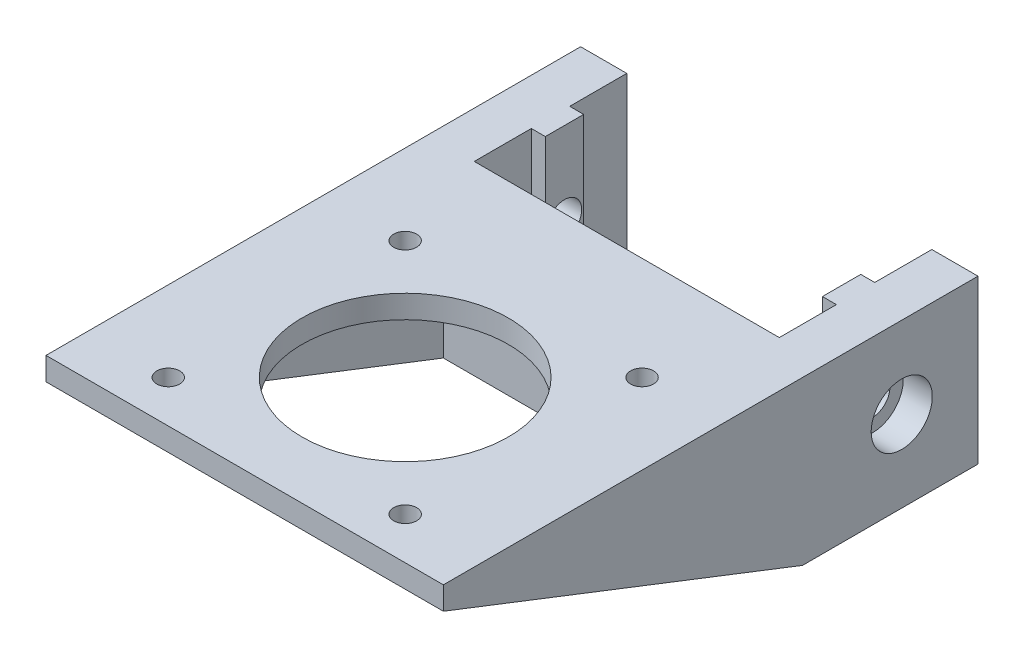
ISO-10303-21;
HEADER;
FILE_DESCRIPTION(('STEP AP214'),'2;1');
FILE_NAME('part.step','',(''),(''),'','','');
FILE_SCHEMA(('AUTOMOTIVE_DESIGN { 1 0 10303 214 1 1 1 1 }'));
ENDSEC;
DATA;
#1=APPLICATION_CONTEXT('core data for automotive mechanical design processes');
#2=APPLICATION_PROTOCOL_DEFINITION('international standard','automotive_design',2000,#1);
#3=PRODUCT_CONTEXT('',#1,'mechanical');
#4=PRODUCT('Part','Part','',(#3));
#5=PRODUCT_RELATED_PRODUCT_CATEGORY('part','',(#4));
#6=PRODUCT_DEFINITION_FORMATION('','',#4);
#7=PRODUCT_DEFINITION_CONTEXT('part definition',#1,'design');
#8=PRODUCT_DEFINITION('design','',#6,#7);
#9=PRODUCT_DEFINITION_SHAPE('','',#8);
#10=(LENGTH_UNIT() NAMED_UNIT(*) SI_UNIT(.MILLI.,.METRE.));
#11=(NAMED_UNIT(*) PLANE_ANGLE_UNIT() SI_UNIT($,.RADIAN.));
#12=(NAMED_UNIT(*) SI_UNIT($,.STERADIAN.) SOLID_ANGLE_UNIT());
#13=UNCERTAINTY_MEASURE_WITH_UNIT(LENGTH_MEASURE(1.E-05),#10,'distance_accuracy_value','');
#14=(GEOMETRIC_REPRESENTATION_CONTEXT(3) GLOBAL_UNCERTAINTY_ASSIGNED_CONTEXT((#13)) GLOBAL_UNIT_ASSIGNED_CONTEXT((#10,
#11,#12)) REPRESENTATION_CONTEXT('',''));
#15=CARTESIAN_POINT('',(0.,0.,0.));
#16=DIRECTION('',(0.,0.,1.));
#17=DIRECTION('',(1.,0.,0.));
#18=AXIS2_PLACEMENT_3D('',#15,#16,#17);
#19=CARTESIAN_POINT('',(124.14478391515,157.565968794144,0.));
#20=DIRECTION('',(1.,0.,0.));
#21=DIRECTION('',(0.,0.,-1.));
#22=AXIS2_PLACEMENT_3D('',#19,#20,#21);
#23=PLANE('',#22);
#24=DIRECTION('',(0.,0.,-1.));
#25=VECTOR('',#24,1.);
#26=CARTESIAN_POINT('',(124.14478391515,157.565968794144,3.));
#27=LINE('',#26,#25);
#28=CARTESIAN_POINT('',(124.14478391515,157.565968794144,3.));
#29=VERTEX_POINT('',#28);
#30=CARTESIAN_POINT('',(124.14478391515,157.565968794144,-19.96));
#31=VERTEX_POINT('',#30);
#32=EDGE_CURVE('E369',#29,#31,#27,.T.);
#33=ORIENTED_EDGE('',*,*,#32,.T.);
#34=DIRECTION('',(0.,1.,0.));
#35=VECTOR('',#34,1.);
#36=CARTESIAN_POINT('',(124.14478391515,136.712115433194,-19.96));
#37=LINE('',#36,#35);
#38=CARTESIAN_POINT('',(124.14478391515,178.865968794144,-19.96));
#39=VERTEX_POINT('',#38);
#40=EDGE_CURVE('E225',#31,#39,#37,.T.);
#41=ORIENTED_EDGE('',*,*,#40,.T.);
#42=DIRECTION('',(0.,0.,1.));
#43=VECTOR('',#42,1.);
#44=CARTESIAN_POINT('',(124.14478391515,178.865968794144,0.));
#45=LINE('',#44,#43);
#46=CARTESIAN_POINT('',(124.14478391515,178.865968794144,50.));
#47=VERTEX_POINT('',#46);
#48=EDGE_CURVE('E371',#39,#47,#45,.T.);
#49=ORIENTED_EDGE('',*,*,#48,.T.);
#50=DIRECTION('',(0.,-1.,0.));
#51=VECTOR('',#50,1.);
#52=CARTESIAN_POINT('',(124.14478391515,178.865968794144,50.));
#53=LINE('',#52,#51);
#54=CARTESIAN_POINT('',(124.14478391515,175.865968794144,50.));
#55=VERTEX_POINT('',#54);
#56=EDGE_CURVE('E373',#47,#55,#53,.T.);
#57=ORIENTED_EDGE('',*,*,#56,.T.);
#58=DIRECTION('',(0.,-0.362828944730076,-0.931855759689266));
#59=VECTOR('',#58,1.);
#60=CARTESIAN_POINT('',(124.14478391515,175.865968794144,50.));
#61=LINE('',#60,#59);
#62=EDGE_CURVE('E375',#55,#29,#61,.T.);
#63=ORIENTED_EDGE('',*,*,#62,.T.);
#64=EDGE_LOOP('',(#33,#41,#49,#57,#63));
#65=FACE_BOUND('',#64,.T.);
#66=CARTESIAN_POINT('',(124.14478391515,168.215968794144,-9.98));
#67=DIRECTION('',(-1.,0.,0.));
#68=DIRECTION('',(0.,0.,1.));
#69=AXIS2_PLACEMENT_3D('',#66,#67,#68);
#70=CIRCLE('',#69,4.);
#71=CARTESIAN_POINT('',(124.14478391515,168.215968794144,-5.98));
#72=VERTEX_POINT('',#71);
#73=EDGE_CURVE('E859',#72,#72,#70,.T.);
#74=ORIENTED_EDGE('',*,*,#73,.T.);
#75=EDGE_LOOP('',(#74));
#76=FACE_BOUND('',#75,.T.);
#77=ADVANCED_FACE('F37',(#65,#76),#23,.T.);
#78=CARTESIAN_POINT('',(114.14478391515,168.215968794144,-9.98));
#79=DIRECTION('',(1.,0.,0.));
#80=DIRECTION('',(0.,0.,-1.));
#81=AXIS2_PLACEMENT_3D('',#78,#79,#80);
#82=CYLINDRICAL_SURFACE('',#81,2.25);
#83=CARTESIAN_POINT('',(116.274788364624,168.215968794144,-9.98));
#84=DIRECTION('',(1.,0.,0.));
#85=DIRECTION('',(0.,0.,-1.));
#86=AXIS2_PLACEMENT_3D('',#83,#84,#85);
#87=CIRCLE('',#86,2.25);
#88=CARTESIAN_POINT('',(116.274788364624,168.215968794144,-12.23));
#89=VERTEX_POINT('',#88);
#90=EDGE_CURVE('E198',#89,#89,#87,.F.);
#91=ORIENTED_EDGE('',*,*,#90,.T.);
#92=EDGE_LOOP('',(#91));
#93=FACE_BOUND('',#92,.T.);
#94=CARTESIAN_POINT('',(120.34478391515,168.215968794144,-9.98));
#95=DIRECTION('',(1.,0.,0.));
#96=DIRECTION('',(0.,0.,-1.));
#97=AXIS2_PLACEMENT_3D('',#94,#95,#96);
#98=CIRCLE('',#97,2.25);
#99=CARTESIAN_POINT('',(120.34478391515,168.215968794144,-12.23));
#100=VERTEX_POINT('',#99);
#101=EDGE_CURVE('E41',#100,#100,#98,.T.);
#102=ORIENTED_EDGE('',*,*,#101,.T.);
#103=EDGE_LOOP('',(#102));
#104=FACE_BOUND('',#103,.T.);
#105=ADVANCED_FACE('F474',(#93,#104),#82,.F.);
#106=CARTESIAN_POINT('',(116.274788364624,184.209121769209,-7.47));
#107=DIRECTION('',(1.,0.,0.));
#108=DIRECTION('',(0.,0.,-1.));
#109=AXIS2_PLACEMENT_3D('',#106,#107,#108);
#110=PLANE('',#109);
#111=DIRECTION('',(0.,-1.,0.));
#112=VECTOR('',#111,1.);
#113=CARTESIAN_POINT('',(116.274788364624,184.209121769209,-7.47));
#114=LINE('',#113,#112);
#115=CARTESIAN_POINT('',(116.274788364624,178.865968794144,-7.47));
#116=VERTEX_POINT('',#115);
#117=CARTESIAN_POINT('',(116.274788364624,157.565968794144,-7.47));
#118=VERTEX_POINT('',#117);
#119=EDGE_CURVE('E176',#116,#118,#114,.T.);
#120=ORIENTED_EDGE('',*,*,#119,.F.);
#121=DIRECTION('',(0.,0.,-1.));
#122=VECTOR('',#121,1.);
#123=CARTESIAN_POINT('',(116.274788364624,178.865968794144,-7.47));
#124=LINE('',#123,#122);
#125=CARTESIAN_POINT('',(116.274788364624,178.865968794144,-12.49));
#126=VERTEX_POINT('',#125);
#127=EDGE_CURVE('E212',#116,#126,#124,.T.);
#128=ORIENTED_EDGE('',*,*,#127,.T.);
#129=DIRECTION('',(0.,-1.,0.));
#130=VECTOR('',#129,1.);
#131=CARTESIAN_POINT('',(116.274788364624,184.209121769209,-12.49));
#132=LINE('',#131,#130);
#133=CARTESIAN_POINT('',(116.274788364624,157.565968794144,-12.49));
#134=VERTEX_POINT('',#133);
#135=EDGE_CURVE('E184',#126,#134,#132,.T.);
#136=ORIENTED_EDGE('',*,*,#135,.T.);
#137=DIRECTION('',(0.,0.,1.));
#138=VECTOR('',#137,1.);
#139=CARTESIAN_POINT('',(116.274788364624,157.565968794144,-7.47));
#140=LINE('',#139,#138);
#141=EDGE_CURVE('E187',#134,#118,#140,.T.);
#142=ORIENTED_EDGE('',*,*,#141,.T.);
#143=EDGE_LOOP('',(#120,#128,#136,#142));
#144=FACE_BOUND('',#143,.T.);
#145=ORIENTED_EDGE('',*,*,#90,.F.);
#146=EDGE_LOOP('',(#145));
#147=FACE_BOUND('',#146,.T.);
#148=ADVANCED_FACE('F188',(#144,#147),#110,.F.);
#149=CARTESIAN_POINT('',(118.10478391515,136.712115433194,-19.96));
#150=DIRECTION('',(1.,0.,0.));
#151=DIRECTION('',(0.,0.,-1.));
#152=AXIS2_PLACEMENT_3D('',#149,#150,#151);
#153=PLANE('',#152);
#154=DIRECTION('',(0.,-1.,0.));
#155=VECTOR('',#154,1.);
#156=CARTESIAN_POINT('',(118.10478391515,184.209121769209,-7.47));
#157=LINE('',#156,#155);
#158=CARTESIAN_POINT('',(118.10478391515,178.865968794144,-7.47));
#159=VERTEX_POINT('',#158);
#160=CARTESIAN_POINT('',(118.10478391515,157.565968794144,-7.47));
#161=VERTEX_POINT('',#160);
#162=EDGE_CURVE('E59',#159,#161,#157,.T.);
#163=ORIENTED_EDGE('',*,*,#162,.T.);
#164=DIRECTION('',(0.,0.,1.));
#165=VECTOR('',#164,1.);
#166=CARTESIAN_POINT('',(118.10478391515,157.565968794144,-19.96));
#167=LINE('',#166,#165);
#168=CARTESIAN_POINT('',(118.10478391515,157.565968794144,0.));
#169=VERTEX_POINT('',#168);
#170=EDGE_CURVE('E197',#161,#169,#167,.T.);
#171=ORIENTED_EDGE('',*,*,#170,.T.);
#172=DIRECTION('',(0.,1.,0.));
#173=VECTOR('',#172,1.);
#174=CARTESIAN_POINT('',(118.10478391515,136.712115433194,0.));
#175=LINE('',#174,#173);
#176=CARTESIAN_POINT('',(118.10478391515,178.865968794144,0.));
#177=VERTEX_POINT('',#176);
#178=EDGE_CURVE('E216',#169,#177,#175,.T.);
#179=ORIENTED_EDGE('',*,*,#178,.T.);
#180=DIRECTION('',(0.,0.,-1.));
#181=VECTOR('',#180,1.);
#182=CARTESIAN_POINT('',(118.10478391515,178.865968794144,-19.96));
#183=LINE('',#182,#181);
#184=EDGE_CURVE('E54',#177,#159,#183,.T.);
#185=ORIENTED_EDGE('',*,*,#184,.T.);
#186=EDGE_LOOP('',(#163,#171,#179,#185));
#187=FACE_BOUND('',#186,.T.);
#188=ADVANCED_FACE('F653',(#187),#153,.F.);
#189=DIRECTION('',(0.,-1.,0.));
#190=VECTOR('',#189,1.);
#191=CARTESIAN_POINT('',(118.10478391515,184.209121769209,-12.49));
#192=LINE('',#191,#190);
#193=CARTESIAN_POINT('',(118.10478391515,178.865968794144,-12.49));
#194=VERTEX_POINT('',#193);
#195=CARTESIAN_POINT('',(118.10478391515,157.565968794144,-12.49));
#196=VERTEX_POINT('',#195);
#197=EDGE_CURVE('E206',#194,#196,#192,.T.);
#198=ORIENTED_EDGE('',*,*,#197,.F.);
#199=CARTESIAN_POINT('',(118.10478391515,178.865968794144,-19.96));
#200=VERTEX_POINT('',#199);
#201=EDGE_CURVE('E223',#194,#200,#183,.T.);
#202=ORIENTED_EDGE('',*,*,#201,.T.);
#203=DIRECTION('',(0.,1.,0.));
#204=VECTOR('',#203,1.);
#205=CARTESIAN_POINT('',(118.10478391515,136.712115433194,-19.96));
#206=LINE('',#205,#204);
#207=CARTESIAN_POINT('',(118.10478391515,157.565968794144,-19.96));
#208=VERTEX_POINT('',#207);
#209=EDGE_CURVE('E227',#208,#200,#206,.T.);
#210=ORIENTED_EDGE('',*,*,#209,.F.);
#211=EDGE_CURVE('E217',#208,#196,#167,.T.);
#212=ORIENTED_EDGE('',*,*,#211,.T.);
#213=EDGE_LOOP('',(#198,#202,#210,#212));
#214=FACE_BOUND('',#213,.T.);
#215=ADVANCED_FACE('F534',(#214),#153,.F.);
#216=CARTESIAN_POINT('',(77.1447839151503,178.865968794144,0.));
#217=DIRECTION('',(0.,0.,-1.));
#218=DIRECTION('',(-1.,0.,0.));
#219=AXIS2_PLACEMENT_3D('',#216,#217,#218);
#220=PLANE('',#219);
#221=CARTESIAN_POINT('',(88.6447839151503,166.065968794144,0.));
#222=DIRECTION('',(0.,0.,1.));
#223=DIRECTION('',(1.,0.,0.));
#224=AXIS2_PLACEMENT_3D('',#221,#222,#223);
#225=CIRCLE('',#224,3.00000000000001);
#226=CARTESIAN_POINT('',(91.6447839151503,166.065968794144,0.));
#227=VERTEX_POINT('',#226);
#228=EDGE_CURVE('E426',#227,#227,#225,.T.);
#229=ORIENTED_EDGE('',*,*,#228,.T.);
#230=EDGE_LOOP('',(#229));
#231=FACE_BOUND('',#230,.T.);
#232=CARTESIAN_POINT('',(108.64478391515,166.065968794144,0.));
#233=DIRECTION('',(0.,0.,1.));
#234=DIRECTION('',(1.,0.,0.));
#235=AXIS2_PLACEMENT_3D('',#232,#233,#234);
#236=CIRCLE('',#235,3.00000000000001);
#237=CARTESIAN_POINT('',(111.64478391515,166.065968794144,0.));
#238=VERTEX_POINT('',#237);
#239=EDGE_CURVE('E310',#238,#238,#236,.T.);
#240=ORIENTED_EDGE('',*,*,#239,.T.);
#241=EDGE_LOOP('',(#240));
#242=FACE_BOUND('',#241,.T.);
#243=DIRECTION('',(-1.,0.,0.));
#244=VECTOR('',#243,1.);
#245=CARTESIAN_POINT('',(77.1447839151503,178.865968794144,0.));
#246=LINE('',#245,#244);
#247=CARTESIAN_POINT('',(78.1847839151502,178.865968794144,0.));
#248=VERTEX_POINT('',#247);
#249=EDGE_CURVE('E302',#177,#248,#246,.T.);
#250=ORIENTED_EDGE('',*,*,#249,.F.);
#251=ORIENTED_EDGE('',*,*,#178,.F.);
#252=DIRECTION('',(1.,0.,0.));
#253=VECTOR('',#252,1.);
#254=CARTESIAN_POINT('',(77.1447839151503,157.565968794144,0.));
#255=LINE('',#254,#253);
#256=CARTESIAN_POINT('',(78.1847839151502,157.565968794144,0.));
#257=VERTEX_POINT('',#256);
#258=EDGE_CURVE('E305',#257,#169,#255,.T.);
#259=ORIENTED_EDGE('',*,*,#258,.F.);
#260=DIRECTION('',(0.,1.,0.));
#261=VECTOR('',#260,1.);
#262=CARTESIAN_POINT('',(78.1847839151502,136.712115433194,0.));
#263=LINE('',#262,#261);
#264=EDGE_CURVE('E272',#257,#248,#263,.T.);
#265=ORIENTED_EDGE('',*,*,#264,.T.);
#266=EDGE_LOOP('',(#250,#251,#259,#265));
#267=FACE_BOUND('',#266,.T.);
#268=ADVANCED_FACE('F325',(#231,#242,#267),#220,.T.);
#269=CARTESIAN_POINT('',(82.1447839151503,168.215968794144,-9.98));
#270=DIRECTION('',(-1.,0.,0.));
#271=DIRECTION('',(0.,0.,1.));
#272=AXIS2_PLACEMENT_3D('',#269,#270,#271);
#273=CYLINDRICAL_SURFACE('',#272,2.25);
#274=CARTESIAN_POINT('',(80.0147794656765,168.215968794144,-9.98));
#275=DIRECTION('',(1.,0.,0.));
#276=DIRECTION('',(0.,0.,-1.));
#277=AXIS2_PLACEMENT_3D('',#274,#275,#276);
#278=CIRCLE('',#277,2.25);
#279=CARTESIAN_POINT('',(80.0147794656765,168.215968794144,-12.23));
#280=VERTEX_POINT('',#279);
#281=EDGE_CURVE('E248',#280,#280,#278,.T.);
#282=ORIENTED_EDGE('',*,*,#281,.T.);
#283=EDGE_LOOP('',(#282));
#284=FACE_BOUND('',#283,.T.);
#285=CARTESIAN_POINT('',(75.9447839151503,168.215968794144,-9.98));
#286=DIRECTION('',(-1.,0.,0.));
#287=DIRECTION('',(0.,0.,1.));
#288=AXIS2_PLACEMENT_3D('',#285,#286,#287);
#289=CIRCLE('',#288,2.25);
#290=CARTESIAN_POINT('',(75.9447839151503,168.215968794144,-7.73));
#291=VERTEX_POINT('',#290);
#292=EDGE_CURVE('E235',#291,#291,#289,.F.);
#293=ORIENTED_EDGE('',*,*,#292,.F.);
#294=EDGE_LOOP('',(#293));
#295=FACE_BOUND('',#294,.T.);
#296=ADVANCED_FACE('F533',(#284,#295),#273,.F.);
#297=CARTESIAN_POINT('',(78.1847839151502,136.712115433194,-19.96));
#298=DIRECTION('',(1.,0.,0.));
#299=DIRECTION('',(0.,0.,-1.));
#300=AXIS2_PLACEMENT_3D('',#297,#298,#299);
#301=PLANE('',#300);
#302=DIRECTION('',(0.,-1.,0.));
#303=VECTOR('',#302,1.);
#304=CARTESIAN_POINT('',(78.1847839151502,184.209121769209,-7.47));
#305=LINE('',#304,#303);
#306=CARTESIAN_POINT('',(78.1847839151502,178.865968794144,-7.47));
#307=VERTEX_POINT('',#306);
#308=CARTESIAN_POINT('',(78.1847839151502,157.565968794144,-7.47));
#309=VERTEX_POINT('',#308);
#310=EDGE_CURVE('E241',#307,#309,#305,.T.);
#311=ORIENTED_EDGE('',*,*,#310,.F.);
#312=DIRECTION('',(0.,0.,-1.));
#313=VECTOR('',#312,1.);
#314=CARTESIAN_POINT('',(78.1847839151502,178.865968794144,-19.96));
#315=LINE('',#314,#313);
#316=EDGE_CURVE('E273',#248,#307,#315,.T.);
#317=ORIENTED_EDGE('',*,*,#316,.F.);
#318=ORIENTED_EDGE('',*,*,#264,.F.);
#319=DIRECTION('',(0.,0.,1.));
#320=VECTOR('',#319,1.);
#321=CARTESIAN_POINT('',(78.1847839151502,157.565968794144,-19.96));
#322=LINE('',#321,#320);
#323=EDGE_CURVE('E267',#309,#257,#322,.T.);
#324=ORIENTED_EDGE('',*,*,#323,.F.);
#325=EDGE_LOOP('',(#311,#317,#318,#324));
#326=FACE_BOUND('',#325,.T.);
#327=ADVANCED_FACE('F321',(#326),#301,.T.);
#328=CARTESIAN_POINT('',(77.1447839151503,157.565968794144,3.));
#329=DIRECTION('',(0.,1.,0.));
#330=DIRECTION('',(0.,0.,1.));
#331=AXIS2_PLACEMENT_3D('',#328,#329,#330);
#332=PLANE('',#331);
#333=DIRECTION('',(0.,0.,-1.));
#334=VECTOR('',#333,1.);
#335=CARTESIAN_POINT('',(72.1447839151503,157.565968794144,3.));
#336=LINE('',#335,#334);
#337=CARTESIAN_POINT('',(72.1447839151503,157.565968794144,3.));
#338=VERTEX_POINT('',#337);
#339=CARTESIAN_POINT('',(72.1447839151503,157.565968794144,-19.96));
#340=VERTEX_POINT('',#339);
#341=EDGE_CURVE('E281',#338,#340,#336,.T.);
#342=ORIENTED_EDGE('',*,*,#341,.T.);
#343=DIRECTION('',(1.,0.,0.));
#344=VECTOR('',#343,1.);
#345=CARTESIAN_POINT('',(72.1447839151503,157.565968794144,-19.96));
#346=LINE('',#345,#344);
#347=CARTESIAN_POINT('',(78.1847839151502,157.565968794144,-19.96));
#348=VERTEX_POINT('',#347);
#349=EDGE_CURVE('E265',#340,#348,#346,.T.);
#350=ORIENTED_EDGE('',*,*,#349,.T.);
#351=CARTESIAN_POINT('',(78.1847839151502,157.565968794144,-12.49));
#352=VERTEX_POINT('',#351);
#353=EDGE_CURVE('E289',#348,#352,#322,.T.);
#354=ORIENTED_EDGE('',*,*,#353,.T.);
#355=DIRECTION('',(1.,0.,0.));
#356=VECTOR('',#355,1.);
#357=CARTESIAN_POINT('',(78.1847839151502,157.565968794144,-12.49));
#358=LINE('',#357,#356);
#359=CARTESIAN_POINT('',(80.0147794656765,157.565968794144,-12.49));
#360=VERTEX_POINT('',#359);
#361=EDGE_CURVE('E244',#352,#360,#358,.T.);
#362=ORIENTED_EDGE('',*,*,#361,.T.);
#363=DIRECTION('',(0.,0.,1.));
#364=VECTOR('',#363,1.);
#365=CARTESIAN_POINT('',(80.0147794656765,157.565968794144,-7.47));
#366=LINE('',#365,#364);
#367=CARTESIAN_POINT('',(80.0147794656765,157.565968794144,-7.47));
#368=VERTEX_POINT('',#367);
#369=EDGE_CURVE('E247',#360,#368,#366,.T.);
#370=ORIENTED_EDGE('',*,*,#369,.T.);
#371=DIRECTION('',(-1.,0.,0.));
#372=VECTOR('',#371,1.);
#373=CARTESIAN_POINT('',(78.1847839151502,157.565968794144,-7.47));
#374=LINE('',#373,#372);
#375=EDGE_CURVE('E251',#368,#309,#374,.T.);
#376=ORIENTED_EDGE('',*,*,#375,.T.);
#377=ORIENTED_EDGE('',*,*,#323,.T.);
#378=ORIENTED_EDGE('',*,*,#258,.T.);
#379=ORIENTED_EDGE('',*,*,#170,.F.);
#380=DIRECTION('',(1.,0.,0.));
#381=VECTOR('',#380,1.);
#382=CARTESIAN_POINT('',(118.10478391515,157.565968794144,-7.47));
#383=LINE('',#382,#381);
#384=EDGE_CURVE('E180',#118,#161,#383,.T.);
#385=ORIENTED_EDGE('',*,*,#384,.F.);
#386=ORIENTED_EDGE('',*,*,#141,.F.);
#387=DIRECTION('',(-1.,0.,0.));
#388=VECTOR('',#387,1.);
#389=CARTESIAN_POINT('',(118.10478391515,157.565968794144,-12.49));
#390=LINE('',#389,#388);
#391=EDGE_CURVE('E194',#196,#134,#390,.T.);
#392=ORIENTED_EDGE('',*,*,#391,.F.);
#393=ORIENTED_EDGE('',*,*,#211,.F.);
#394=DIRECTION('',(-1.,0.,0.));
#395=VECTOR('',#394,1.);
#396=CARTESIAN_POINT('',(124.14478391515,157.565968794144,-19.96));
#397=LINE('',#396,#395);
#398=EDGE_CURVE('E213',#31,#208,#397,.T.);
#399=ORIENTED_EDGE('',*,*,#398,.F.);
#400=ORIENTED_EDGE('',*,*,#32,.F.);
#401=DIRECTION('',(-1.,0.,0.));
#402=VECTOR('',#401,1.);
#403=CARTESIAN_POINT('',(124.14478391515,157.565968794144,3.));
#404=LINE('',#403,#402);
#405=CARTESIAN_POINT('',(119.14478391515,157.565968794144,3.));
#406=VERTEX_POINT('',#405);
#407=EDGE_CURVE('E377',#29,#406,#404,.T.);
#408=ORIENTED_EDGE('',*,*,#407,.T.);
#409=DIRECTION('',(1.,0.,0.));
#410=VECTOR('',#409,1.);
#411=CARTESIAN_POINT('',(77.1447839151503,157.565968794144,3.));
#412=LINE('',#411,#410);
#413=CARTESIAN_POINT('',(77.1447839151503,157.565968794144,3.));
#414=VERTEX_POINT('',#413);
#415=EDGE_CURVE('E46',#414,#406,#412,.T.);
#416=ORIENTED_EDGE('',*,*,#415,.F.);
#417=DIRECTION('',(1.,0.,0.));
#418=VECTOR('',#417,1.);
#419=CARTESIAN_POINT('',(72.1447839151503,157.565968794144,3.));
#420=LINE('',#419,#418);
#421=EDGE_CURVE('E363',#338,#414,#420,.T.);
#422=ORIENTED_EDGE('',*,*,#421,.F.);
#423=EDGE_LOOP('',(#342,#350,#354,#362,#370,#376,#377,#378,#379,#385,#386,#392,#393,#399,#400,
#408,#416,#422));
#424=FACE_BOUND('',#423,.T.);
#425=ADVANCED_FACE('F39',(#424),#332,.F.);
#426=CARTESIAN_POINT('',(77.1447839151503,178.865968794144,3.));
#427=DIRECTION('',(0.,-1.,0.));
#428=DIRECTION('',(0.,0.,-1.));
#429=AXIS2_PLACEMENT_3D('',#426,#427,#428);
#430=PLANE('',#429);
#431=ORIENTED_EDGE('',*,*,#48,.F.);
#432=DIRECTION('',(1.,0.,0.));
#433=VECTOR('',#432,1.);
#434=CARTESIAN_POINT('',(124.14478391515,178.865968794144,-19.96));
#435=LINE('',#434,#433);
#436=EDGE_CURVE('E220',#200,#39,#435,.T.);
#437=ORIENTED_EDGE('',*,*,#436,.F.);
#438=ORIENTED_EDGE('',*,*,#201,.F.);
#439=DIRECTION('',(1.,0.,0.));
#440=VECTOR('',#439,1.);
#441=CARTESIAN_POINT('',(118.10478391515,178.865968794144,-12.49));
#442=LINE('',#441,#440);
#443=EDGE_CURVE('E202',#126,#194,#442,.T.);
#444=ORIENTED_EDGE('',*,*,#443,.F.);
#445=ORIENTED_EDGE('',*,*,#127,.F.);
#446=DIRECTION('',(-1.,0.,0.));
#447=VECTOR('',#446,1.);
#448=CARTESIAN_POINT('',(118.10478391515,178.865968794144,-7.47));
#449=LINE('',#448,#447);
#450=EDGE_CURVE('E181',#159,#116,#449,.T.);
#451=ORIENTED_EDGE('',*,*,#450,.F.);
#452=ORIENTED_EDGE('',*,*,#184,.F.);
#453=ORIENTED_EDGE('',*,*,#249,.T.);
#454=ORIENTED_EDGE('',*,*,#316,.T.);
#455=DIRECTION('',(1.,0.,0.));
#456=VECTOR('',#455,1.);
#457=CARTESIAN_POINT('',(78.1847839151502,178.865968794144,-7.47));
#458=LINE('',#457,#456);
#459=CARTESIAN_POINT('',(80.0147794656765,178.865968794144,-7.47));
#460=VERTEX_POINT('',#459);
#461=EDGE_CURVE('E240',#307,#460,#458,.T.);
#462=ORIENTED_EDGE('',*,*,#461,.T.);
#463=DIRECTION('',(0.,0.,-1.));
#464=VECTOR('',#463,1.);
#465=CARTESIAN_POINT('',(80.0147794656765,178.865968794144,-7.47));
#466=LINE('',#465,#464);
#467=CARTESIAN_POINT('',(80.0147794656765,178.865968794144,-12.49));
#468=VERTEX_POINT('',#467);
#469=EDGE_CURVE('E238',#460,#468,#466,.T.);
#470=ORIENTED_EDGE('',*,*,#469,.T.);
#471=DIRECTION('',(-1.,0.,0.));
#472=VECTOR('',#471,1.);
#473=CARTESIAN_POINT('',(78.1847839151502,178.865968794144,-12.49));
#474=LINE('',#473,#472);
#475=CARTESIAN_POINT('',(78.1847839151502,178.865968794144,-12.49));
#476=VERTEX_POINT('',#475);
#477=EDGE_CURVE('E243',#468,#476,#474,.T.);
#478=ORIENTED_EDGE('',*,*,#477,.T.);
#479=CARTESIAN_POINT('',(78.1847839151502,178.865968794144,-19.96));
#480=VERTEX_POINT('',#479);
#481=EDGE_CURVE('E264',#476,#480,#315,.T.);
#482=ORIENTED_EDGE('',*,*,#481,.T.);
#483=DIRECTION('',(-1.,0.,0.));
#484=VECTOR('',#483,1.);
#485=CARTESIAN_POINT('',(72.1447839151503,178.865968794144,-19.96));
#486=LINE('',#485,#484);
#487=CARTESIAN_POINT('',(72.1447839151503,178.865968794144,-19.96));
#488=VERTEX_POINT('',#487);
#489=EDGE_CURVE('E269',#480,#488,#486,.T.);
#490=ORIENTED_EDGE('',*,*,#489,.T.);
#491=DIRECTION('',(0.,0.,1.));
#492=VECTOR('',#491,1.);
#493=CARTESIAN_POINT('',(72.1447839151503,178.865968794144,0.));
#494=LINE('',#493,#492);
#495=CARTESIAN_POINT('',(72.1447839151503,178.865968794144,50.));
#496=VERTEX_POINT('',#495);
#497=EDGE_CURVE('E348',#488,#496,#494,.T.);
#498=ORIENTED_EDGE('',*,*,#497,.T.);
#499=DIRECTION('',(1.,0.,0.));
#500=VECTOR('',#499,1.);
#501=CARTESIAN_POINT('',(119.14478391515,178.865968794144,50.));
#502=LINE('',#501,#500);
#503=EDGE_CURVE('E349',#496,#47,#502,.T.);
#504=ORIENTED_EDGE('',*,*,#503,.T.);
#505=EDGE_LOOP('',(#431,#437,#438,#444,#445,#451,#452,#453,#454,#462,#470,#478,#482,#490,#498,#504));
#506=FACE_BOUND('',#505,.T.);
#507=CARTESIAN_POINT('',(113.64478391515,178.865968794144,44.5001792058897));
#508=DIRECTION('',(0.,1.,0.));
#509=DIRECTION('',(0.,0.,1.));
#510=AXIS2_PLACEMENT_3D('',#507,#508,#509);
#511=CIRCLE('',#510,1.5);
#512=CARTESIAN_POINT('',(113.64478391515,178.865968794144,46.0001792058897));
#513=VERTEX_POINT('',#512);
#514=EDGE_CURVE('E406',#513,#513,#511,.T.);
#515=ORIENTED_EDGE('',*,*,#514,.F.);
#516=EDGE_LOOP('',(#515));
#517=FACE_BOUND('',#516,.T.);
#518=CARTESIAN_POINT('',(82.6447839151503,178.865968794144,44.5001792058897));
#519=DIRECTION('',(0.,1.,0.));
#520=DIRECTION('',(0.,0.,1.));
#521=AXIS2_PLACEMENT_3D('',#518,#519,#520);
#522=CIRCLE('',#521,1.5);
#523=CARTESIAN_POINT('',(82.6447839151503,178.865968794144,46.0001792058897));
#524=VERTEX_POINT('',#523);
#525=EDGE_CURVE('E400',#524,#524,#522,.T.);
#526=ORIENTED_EDGE('',*,*,#525,.F.);
#527=EDGE_LOOP('',(#526));
#528=FACE_BOUND('',#527,.T.);
#529=CARTESIAN_POINT('',(82.6447839151503,178.865968794144,13.5001792058897));
#530=DIRECTION('',(0.,1.,0.));
#531=DIRECTION('',(0.,0.,1.));
#532=AXIS2_PLACEMENT_3D('',#529,#530,#531);
#533=CIRCLE('',#532,1.5);
#534=CARTESIAN_POINT('',(82.6447839151503,178.865968794144,15.0001792058897));
#535=VERTEX_POINT('',#534);
#536=EDGE_CURVE('E394',#535,#535,#533,.T.);
#537=ORIENTED_EDGE('',*,*,#536,.F.);
#538=EDGE_LOOP('',(#537));
#539=FACE_BOUND('',#538,.T.);
#540=CARTESIAN_POINT('',(113.64478391515,178.865968794144,13.5001792058897));
#541=DIRECTION('',(0.,1.,0.));
#542=DIRECTION('',(0.,0.,1.));
#543=AXIS2_PLACEMENT_3D('',#540,#541,#542);
#544=CIRCLE('',#543,1.5);
#545=CARTESIAN_POINT('',(113.64478391515,178.865968794144,15.0001792058897));
#546=VERTEX_POINT('',#545);
#547=EDGE_CURVE('E388',#546,#546,#544,.T.);
#548=ORIENTED_EDGE('',*,*,#547,.F.);
#549=EDGE_LOOP('',(#548));
#550=FACE_BOUND('',#549,.T.);
#551=CARTESIAN_POINT('',(98.1447839151503,178.865968794144,29.0001792058896));
#552=DIRECTION('',(0.,1.,0.));
#553=DIRECTION('',(0.,0.,1.));
#554=AXIS2_PLACEMENT_3D('',#551,#552,#553);
#555=CIRCLE('',#554,13.5);
#556=CARTESIAN_POINT('',(98.1447839151503,178.865968794144,42.5001792058896));
#557=VERTEX_POINT('',#556);
#558=EDGE_CURVE('E384',#557,#557,#555,.T.);
#559=ORIENTED_EDGE('',*,*,#558,.F.);
#560=EDGE_LOOP('',(#559));
#561=FACE_BOUND('',#560,.T.);
#562=ADVANCED_FACE('F314',(#506,#517,#528,#539,#550,#561),#430,.F.);
#563=CARTESIAN_POINT('',(77.1447839151503,178.865968794144,3.));
#564=DIRECTION('',(0.,0.,-1.));
#565=DIRECTION('',(-1.,0.,0.));
#566=AXIS2_PLACEMENT_3D('',#563,#564,#565);
#567=PLANE('',#566);
#568=CARTESIAN_POINT('',(88.6447839151503,166.065968794144,3.));
#569=DIRECTION('',(0.,0.,1.));
#570=DIRECTION('',(1.,0.,0.));
#571=AXIS2_PLACEMENT_3D('',#568,#569,#570);
#572=CIRCLE('',#571,3.00000000000001);
#573=CARTESIAN_POINT('',(91.6447839151503,166.065968794144,3.));
#574=VERTEX_POINT('',#573);
#575=EDGE_CURVE('E425',#574,#574,#572,.T.);
#576=ORIENTED_EDGE('',*,*,#575,.F.);
#577=EDGE_LOOP('',(#576));
#578=FACE_BOUND('',#577,.T.);
#579=CARTESIAN_POINT('',(108.64478391515,166.065968794144,3.));
#580=DIRECTION('',(0.,0.,1.));
#581=DIRECTION('',(1.,0.,0.));
#582=AXIS2_PLACEMENT_3D('',#579,#580,#581);
#583=CIRCLE('',#582,3.00000000000001);
#584=CARTESIAN_POINT('',(111.64478391515,166.065968794144,3.));
#585=VERTEX_POINT('',#584);
#586=EDGE_CURVE('E429',#585,#585,#583,.T.);
#587=ORIENTED_EDGE('',*,*,#586,.F.);
#588=EDGE_LOOP('',(#587));
#589=FACE_BOUND('',#588,.T.);
#590=DIRECTION('',(0.,1.,0.));
#591=VECTOR('',#590,1.);
#592=CARTESIAN_POINT('',(119.14478391515,157.565968794144,3.));
#593=LINE('',#592,#591);
#594=CARTESIAN_POINT('',(119.14478391515,175.865968794144,3.));
#595=VERTEX_POINT('',#594);
#596=EDGE_CURVE('E11',#406,#595,#593,.T.);
#597=ORIENTED_EDGE('',*,*,#596,.T.);
#598=DIRECTION('',(-1.,0.,0.));
#599=VECTOR('',#598,1.);
#600=CARTESIAN_POINT('',(77.1447839151503,175.865968794144,3.));
#601=LINE('',#600,#599);
#602=CARTESIAN_POINT('',(77.1447839151503,175.865968794144,3.));
#603=VERTEX_POINT('',#602);
#604=EDGE_CURVE('E422',#595,#603,#601,.T.);
#605=ORIENTED_EDGE('',*,*,#604,.T.);
#606=DIRECTION('',(0.,-1.,0.));
#607=VECTOR('',#606,1.);
#608=CARTESIAN_POINT('',(77.1447839151503,157.565968794144,3.));
#609=LINE('',#608,#607);
#610=EDGE_CURVE('E304',#603,#414,#609,.T.);
#611=ORIENTED_EDGE('',*,*,#610,.T.);
#612=ORIENTED_EDGE('',*,*,#415,.T.);
#613=EDGE_LOOP('',(#597,#605,#611,#612));
#614=FACE_BOUND('',#613,.T.);
#615=ADVANCED_FACE('F440',(#578,#589,#614),#567,.F.);
#616=CARTESIAN_POINT('',(108.64478391515,166.065968794144,0.));
#617=DIRECTION('',(0.,0.,1.));
#618=DIRECTION('',(1.,0.,0.));
#619=AXIS2_PLACEMENT_3D('',#616,#617,#618);
#620=CYLINDRICAL_SURFACE('',#619,3.00000000000001);
#621=ORIENTED_EDGE('',*,*,#239,.F.);
#622=EDGE_LOOP('',(#621));
#623=FACE_BOUND('',#622,.T.);
#624=ORIENTED_EDGE('',*,*,#586,.T.);
#625=EDGE_LOOP('',(#624));
#626=FACE_BOUND('',#625,.T.);
#627=ADVANCED_FACE('F524',(#623,#626),#620,.F.);
#628=CARTESIAN_POINT('',(88.6447839151503,166.065968794144,0.));
#629=DIRECTION('',(0.,0.,1.));
#630=DIRECTION('',(1.,0.,0.));
#631=AXIS2_PLACEMENT_3D('',#628,#629,#630);
#632=CYLINDRICAL_SURFACE('',#631,3.00000000000001);
#633=ORIENTED_EDGE('',*,*,#228,.F.);
#634=EDGE_LOOP('',(#633));
#635=FACE_BOUND('',#634,.T.);
#636=ORIENTED_EDGE('',*,*,#575,.T.);
#637=EDGE_LOOP('',(#636));
#638=FACE_BOUND('',#637,.T.);
#639=ADVANCED_FACE('F518',(#635,#638),#632,.F.);
#640=CARTESIAN_POINT('',(119.14478391515,175.865968794144,50.));
#641=DIRECTION('',(0.,-1.,0.));
#642=DIRECTION('',(0.,0.,-1.));
#643=AXIS2_PLACEMENT_3D('',#640,#641,#642);
#644=PLANE('',#643);
#645=CARTESIAN_POINT('',(113.64478391515,175.865968794144,44.5001792058897));
#646=DIRECTION('',(0.,1.,0.));
#647=DIRECTION('',(0.,0.,1.));
#648=AXIS2_PLACEMENT_3D('',#645,#646,#647);
#649=CIRCLE('',#648,1.5);
#650=CARTESIAN_POINT('',(113.64478391515,175.865968794144,46.0001792058897));
#651=VERTEX_POINT('',#650);
#652=EDGE_CURVE('E409',#651,#651,#649,.T.);
#653=ORIENTED_EDGE('',*,*,#652,.T.);
#654=EDGE_LOOP('',(#653));
#655=FACE_BOUND('',#654,.T.);
#656=CARTESIAN_POINT('',(82.6447839151503,175.865968794144,44.5001792058897));
#657=DIRECTION('',(0.,1.,0.));
#658=DIRECTION('',(0.,0.,1.));
#659=AXIS2_PLACEMENT_3D('',#656,#657,#658);
#660=CIRCLE('',#659,1.5);
#661=CARTESIAN_POINT('',(82.6447839151503,175.865968794144,46.0001792058897));
#662=VERTEX_POINT('',#661);
#663=EDGE_CURVE('E403',#662,#662,#660,.T.);
#664=ORIENTED_EDGE('',*,*,#663,.T.);
#665=EDGE_LOOP('',(#664));
#666=FACE_BOUND('',#665,.T.);
#667=CARTESIAN_POINT('',(82.6447839151503,175.865968794144,13.5001792058897));
#668=DIRECTION('',(0.,1.,0.));
#669=DIRECTION('',(0.,0.,1.));
#670=AXIS2_PLACEMENT_3D('',#667,#668,#669);
#671=CIRCLE('',#670,1.5);
#672=CARTESIAN_POINT('',(82.6447839151503,175.865968794144,15.0001792058897));
#673=VERTEX_POINT('',#672);
#674=EDGE_CURVE('E397',#673,#673,#671,.T.);
#675=ORIENTED_EDGE('',*,*,#674,.T.);
#676=EDGE_LOOP('',(#675));
#677=FACE_BOUND('',#676,.T.);
#678=CARTESIAN_POINT('',(113.64478391515,175.865968794144,13.5001792058897));
#679=DIRECTION('',(0.,1.,0.));
#680=DIRECTION('',(0.,0.,1.));
#681=AXIS2_PLACEMENT_3D('',#678,#679,#680);
#682=CIRCLE('',#681,1.5);
#683=CARTESIAN_POINT('',(113.64478391515,175.865968794144,15.0001792058897));
#684=VERTEX_POINT('',#683);
#685=EDGE_CURVE('E391',#684,#684,#682,.T.);
#686=ORIENTED_EDGE('',*,*,#685,.T.);
#687=EDGE_LOOP('',(#686));
#688=FACE_BOUND('',#687,.T.);
#689=CARTESIAN_POINT('',(98.1447839151503,175.865968794144,29.0001792058896));
#690=DIRECTION('',(0.,1.,0.));
#691=DIRECTION('',(0.,0.,1.));
#692=AXIS2_PLACEMENT_3D('',#689,#690,#691);
#693=CIRCLE('',#692,13.5);
#694=CARTESIAN_POINT('',(98.1447839151503,175.865968794144,42.5001792058896));
#695=VERTEX_POINT('',#694);
#696=EDGE_CURVE('E385',#695,#695,#693,.T.);
#697=ORIENTED_EDGE('',*,*,#696,.T.);
#698=EDGE_LOOP('',(#697));
#699=FACE_BOUND('',#698,.T.);
#700=ORIENTED_EDGE('',*,*,#604,.F.);
#701=DIRECTION('',(0.,0.,-1.));
#702=VECTOR('',#701,1.);
#703=CARTESIAN_POINT('',(119.14478391515,175.865968794144,0.));
#704=LINE('',#703,#702);
#705=CARTESIAN_POINT('',(119.14478391515,175.865968794144,50.));
#706=VERTEX_POINT('',#705);
#707=EDGE_CURVE('E414',#706,#595,#704,.T.);
#708=ORIENTED_EDGE('',*,*,#707,.F.);
#709=DIRECTION('',(1.,0.,0.));
#710=VECTOR('',#709,1.);
#711=CARTESIAN_POINT('',(119.14478391515,175.865968794144,50.));
#712=LINE('',#711,#710);
#713=CARTESIAN_POINT('',(77.1447839151503,175.865968794144,50.));
#714=VERTEX_POINT('',#713);
#715=EDGE_CURVE('E419',#714,#706,#712,.T.);
#716=ORIENTED_EDGE('',*,*,#715,.F.);
#717=DIRECTION('',(0.,0.,1.));
#718=VECTOR('',#717,1.);
#719=CARTESIAN_POINT('',(77.1447839151503,175.865968794144,0.));
#720=LINE('',#719,#718);
#721=EDGE_CURVE('E416',#603,#714,#720,.T.);
#722=ORIENTED_EDGE('',*,*,#721,.F.);
#723=EDGE_LOOP('',(#700,#708,#716,#722));
#724=FACE_BOUND('',#723,.T.);
#725=ADVANCED_FACE('F515',(#655,#666,#677,#688,#699,#724),#644,.T.);
#726=CARTESIAN_POINT('',(119.14478391515,175.865968794144,50.));
#727=DIRECTION('',(0.,0.,1.));
#728=DIRECTION('',(1.,0.,0.));
#729=AXIS2_PLACEMENT_3D('',#726,#727,#728);
#730=PLANE('',#729);
#731=ORIENTED_EDGE('',*,*,#503,.F.);
#732=DIRECTION('',(0.,-1.,0.));
#733=VECTOR('',#732,1.);
#734=CARTESIAN_POINT('',(72.1447839151503,178.865968794144,50.));
#735=LINE('',#734,#733);
#736=CARTESIAN_POINT('',(72.1447839151503,175.865968794144,50.));
#737=VERTEX_POINT('',#736);
#738=EDGE_CURVE('E353',#496,#737,#735,.T.);
#739=ORIENTED_EDGE('',*,*,#738,.T.);
#740=DIRECTION('',(1.,0.,0.));
#741=VECTOR('',#740,1.);
#742=CARTESIAN_POINT('',(72.1447839151503,175.865968794144,50.));
#743=LINE('',#742,#741);
#744=EDGE_CURVE('E360',#737,#714,#743,.T.);
#745=ORIENTED_EDGE('',*,*,#744,.T.);
#746=ORIENTED_EDGE('',*,*,#715,.T.);
#747=DIRECTION('',(-1.,0.,0.));
#748=VECTOR('',#747,1.);
#749=CARTESIAN_POINT('',(124.14478391515,175.865968794144,50.));
#750=LINE('',#749,#748);
#751=EDGE_CURVE('E382',#55,#706,#750,.T.);
#752=ORIENTED_EDGE('',*,*,#751,.F.);
#753=ORIENTED_EDGE('',*,*,#56,.F.);
#754=EDGE_LOOP('',(#731,#739,#745,#746,#752,#753));
#755=FACE_BOUND('',#754,.T.);
#756=ADVANCED_FACE('F455',(#755),#730,.T.);
#757=CARTESIAN_POINT('',(113.64478391515,175.865968794144,44.5001792058897));
#758=DIRECTION('',(0.,1.,0.));
#759=DIRECTION('',(0.,0.,1.));
#760=AXIS2_PLACEMENT_3D('',#757,#758,#759);
#761=CYLINDRICAL_SURFACE('',#760,1.5);
#762=ORIENTED_EDGE('',*,*,#652,.F.);
#763=EDGE_LOOP('',(#762));
#764=FACE_BOUND('',#763,.T.);
#765=ORIENTED_EDGE('',*,*,#514,.T.);
#766=EDGE_LOOP('',(#765));
#767=FACE_BOUND('',#766,.T.);
#768=ADVANCED_FACE('F510',(#764,#767),#761,.F.);
#769=CARTESIAN_POINT('',(82.6447839151503,175.865968794144,44.5001792058897));
#770=DIRECTION('',(0.,1.,0.));
#771=DIRECTION('',(0.,0.,1.));
#772=AXIS2_PLACEMENT_3D('',#769,#770,#771);
#773=CYLINDRICAL_SURFACE('',#772,1.5);
#774=ORIENTED_EDGE('',*,*,#663,.F.);
#775=EDGE_LOOP('',(#774));
#776=FACE_BOUND('',#775,.T.);
#777=ORIENTED_EDGE('',*,*,#525,.T.);
#778=EDGE_LOOP('',(#777));
#779=FACE_BOUND('',#778,.T.);
#780=ADVANCED_FACE('F506',(#776,#779),#773,.F.);
#781=CARTESIAN_POINT('',(82.6447839151503,175.865968794144,13.5001792058897));
#782=DIRECTION('',(0.,1.,0.));
#783=DIRECTION('',(0.,0.,1.));
#784=AXIS2_PLACEMENT_3D('',#781,#782,#783);
#785=CYLINDRICAL_SURFACE('',#784,1.5);
#786=ORIENTED_EDGE('',*,*,#674,.F.);
#787=EDGE_LOOP('',(#786));
#788=FACE_BOUND('',#787,.T.);
#789=ORIENTED_EDGE('',*,*,#536,.T.);
#790=EDGE_LOOP('',(#789));
#791=FACE_BOUND('',#790,.T.);
#792=ADVANCED_FACE('F502',(#788,#791),#785,.F.);
#793=CARTESIAN_POINT('',(113.64478391515,175.865968794144,13.5001792058897));
#794=DIRECTION('',(0.,1.,0.));
#795=DIRECTION('',(0.,0.,1.));
#796=AXIS2_PLACEMENT_3D('',#793,#794,#795);
#797=CYLINDRICAL_SURFACE('',#796,1.5);
#798=ORIENTED_EDGE('',*,*,#685,.F.);
#799=EDGE_LOOP('',(#798));
#800=FACE_BOUND('',#799,.T.);
#801=ORIENTED_EDGE('',*,*,#547,.T.);
#802=EDGE_LOOP('',(#801));
#803=FACE_BOUND('',#802,.T.);
#804=ADVANCED_FACE('F498',(#800,#803),#797,.F.);
#805=CARTESIAN_POINT('',(98.1447839151503,175.865968794144,29.0001792058896));
#806=DIRECTION('',(0.,1.,0.));
#807=DIRECTION('',(0.,0.,1.));
#808=AXIS2_PLACEMENT_3D('',#805,#806,#807);
#809=CYLINDRICAL_SURFACE('',#808,13.5);
#810=ORIENTED_EDGE('',*,*,#696,.F.);
#811=EDGE_LOOP('',(#810));
#812=FACE_BOUND('',#811,.T.);
#813=ORIENTED_EDGE('',*,*,#558,.T.);
#814=EDGE_LOOP('',(#813));
#815=FACE_BOUND('',#814,.T.);
#816=ADVANCED_FACE('F491',(#812,#815),#809,.F.);
#817=CARTESIAN_POINT('',(119.14478391515,157.565968794144,0.));
#818=DIRECTION('',(1.,0.,0.));
#819=DIRECTION('',(0.,0.,-1.));
#820=AXIS2_PLACEMENT_3D('',#817,#818,#819);
#821=PLANE('',#820);
#822=DIRECTION('',(0.,-0.362828944730076,-0.931855759689266));
#823=VECTOR('',#822,1.);
#824=CARTESIAN_POINT('',(119.14478391515,175.865968794144,50.));
#825=LINE('',#824,#823);
#826=EDGE_CURVE('E366',#706,#406,#825,.T.);
#827=ORIENTED_EDGE('',*,*,#826,.F.);
#828=ORIENTED_EDGE('',*,*,#707,.T.);
#829=ORIENTED_EDGE('',*,*,#596,.F.);
#830=EDGE_LOOP('',(#827,#828,#829));
#831=FACE_BOUND('',#830,.T.);
#832=ADVANCED_FACE('F487',(#831),#821,.F.);
#833=CARTESIAN_POINT('',(124.14478391515,175.865968794144,50.));
#834=DIRECTION('',(0.,0.931855759689266,-0.362828944730076));
#835=DIRECTION('',(0.,0.362828944730076,0.931855759689266));
#836=AXIS2_PLACEMENT_3D('',#833,#834,#835);
#837=PLANE('',#836);
#838=ORIENTED_EDGE('',*,*,#826,.T.);
#839=ORIENTED_EDGE('',*,*,#407,.F.);
#840=ORIENTED_EDGE('',*,*,#62,.F.);
#841=ORIENTED_EDGE('',*,*,#751,.T.);
#842=EDGE_LOOP('',(#838,#839,#840,#841));
#843=FACE_BOUND('',#842,.T.);
#844=ADVANCED_FACE('F490',(#843),#837,.F.);
#845=CARTESIAN_POINT('',(77.1447839151503,157.565968794144,0.));
#846=DIRECTION('',(1.,0.,0.));
#847=DIRECTION('',(0.,0.,-1.));
#848=AXIS2_PLACEMENT_3D('',#845,#846,#847);
#849=PLANE('',#848);
#850=ORIENTED_EDGE('',*,*,#610,.F.);
#851=ORIENTED_EDGE('',*,*,#721,.T.);
#852=DIRECTION('',(0.,-0.362828944730076,-0.931855759689266));
#853=VECTOR('',#852,1.);
#854=CARTESIAN_POINT('',(77.1447839151503,175.865968794144,50.));
#855=LINE('',#854,#853);
#856=EDGE_CURVE('E292',#714,#414,#855,.T.);
#857=ORIENTED_EDGE('',*,*,#856,.T.);
#858=EDGE_LOOP('',(#850,#851,#857));
#859=FACE_BOUND('',#858,.T.);
#860=ADVANCED_FACE('F451',(#859),#849,.T.);
#861=CARTESIAN_POINT('',(72.1447839151503,175.865968794144,50.));
#862=DIRECTION('',(0.,-0.931855759689266,0.362828944730076));
#863=DIRECTION('',(0.,-0.362828944730076,-0.931855759689266));
#864=AXIS2_PLACEMENT_3D('',#861,#862,#863);
#865=PLANE('',#864);
#866=ORIENTED_EDGE('',*,*,#856,.F.);
#867=ORIENTED_EDGE('',*,*,#744,.F.);
#868=DIRECTION('',(0.,-0.362828944730076,-0.931855759689266));
#869=VECTOR('',#868,1.);
#870=CARTESIAN_POINT('',(72.1447839151503,175.865968794144,50.));
#871=LINE('',#870,#869);
#872=EDGE_CURVE('E355',#737,#338,#871,.T.);
#873=ORIENTED_EDGE('',*,*,#872,.T.);
#874=ORIENTED_EDGE('',*,*,#421,.T.);
#875=EDGE_LOOP('',(#866,#867,#873,#874));
#876=FACE_BOUND('',#875,.T.);
#877=ADVANCED_FACE('F448',(#876),#865,.T.);
#878=CARTESIAN_POINT('',(72.1447839151503,157.565968794144,0.));
#879=DIRECTION('',(1.,0.,0.));
#880=DIRECTION('',(0.,0.,-1.));
#881=AXIS2_PLACEMENT_3D('',#878,#879,#880);
#882=PLANE('',#881);
#883=CARTESIAN_POINT('',(72.1447839151503,168.215968794144,-9.98));
#884=DIRECTION('',(-1.,0.,0.));
#885=DIRECTION('',(0.,0.,1.));
#886=AXIS2_PLACEMENT_3D('',#883,#884,#885);
#887=CIRCLE('',#886,4.);
#888=CARTESIAN_POINT('',(72.1447839151503,168.215968794144,-5.98));
#889=VERTEX_POINT('',#888);
#890=EDGE_CURVE('E219',#889,#889,#887,.T.);
#891=ORIENTED_EDGE('',*,*,#890,.F.);
#892=EDGE_LOOP('',(#891));
#893=FACE_BOUND('',#892,.T.);
#894=ORIENTED_EDGE('',*,*,#341,.F.);
#895=ORIENTED_EDGE('',*,*,#872,.F.);
#896=ORIENTED_EDGE('',*,*,#738,.F.);
#897=ORIENTED_EDGE('',*,*,#497,.F.);
#898=DIRECTION('',(0.,1.,0.));
#899=VECTOR('',#898,1.);
#900=CARTESIAN_POINT('',(72.1447839151503,136.712115433194,-19.96));
#901=LINE('',#900,#899);
#902=EDGE_CURVE('E268',#340,#488,#901,.T.);
#903=ORIENTED_EDGE('',*,*,#902,.F.);
#904=EDGE_LOOP('',(#894,#895,#896,#897,#903));
#905=FACE_BOUND('',#904,.T.);
#906=ADVANCED_FACE('F458',(#893,#905),#882,.F.);
#907=CARTESIAN_POINT('',(72.1447839151503,136.712115433194,-19.96));
#908=DIRECTION('',(0.,0.,-1.));
#909=DIRECTION('',(-1.,0.,0.));
#910=AXIS2_PLACEMENT_3D('',#907,#908,#909);
#911=PLANE('',#910);
#912=ORIENTED_EDGE('',*,*,#349,.F.);
#913=ORIENTED_EDGE('',*,*,#902,.T.);
#914=ORIENTED_EDGE('',*,*,#489,.F.);
#915=DIRECTION('',(0.,1.,0.));
#916=VECTOR('',#915,1.);
#917=CARTESIAN_POINT('',(78.1847839151502,136.712115433194,-19.96));
#918=LINE('',#917,#916);
#919=EDGE_CURVE('E276',#348,#480,#918,.T.);
#920=ORIENTED_EDGE('',*,*,#919,.F.);
#921=EDGE_LOOP('',(#912,#913,#914,#920));
#922=FACE_BOUND('',#921,.T.);
#923=ADVANCED_FACE('F345',(#922),#911,.T.);
#924=DIRECTION('',(0.,-1.,0.));
#925=VECTOR('',#924,1.);
#926=CARTESIAN_POINT('',(78.1847839151502,184.209121769209,-12.49));
#927=LINE('',#926,#925);
#928=EDGE_CURVE('E254',#476,#352,#927,.T.);
#929=ORIENTED_EDGE('',*,*,#928,.T.);
#930=ORIENTED_EDGE('',*,*,#353,.F.);
#931=ORIENTED_EDGE('',*,*,#919,.T.);
#932=ORIENTED_EDGE('',*,*,#481,.F.);
#933=EDGE_LOOP('',(#929,#930,#931,#932));
#934=FACE_BOUND('',#933,.T.);
#935=ADVANCED_FACE('F339',(#934),#301,.T.);
#936=CARTESIAN_POINT('',(78.1847839151502,184.209121769209,-7.47));
#937=DIRECTION('',(0.,0.,1.));
#938=DIRECTION('',(1.,0.,0.));
#939=AXIS2_PLACEMENT_3D('',#936,#937,#938);
#940=PLANE('',#939);
#941=ORIENTED_EDGE('',*,*,#461,.F.);
#942=ORIENTED_EDGE('',*,*,#310,.T.);
#943=ORIENTED_EDGE('',*,*,#375,.F.);
#944=DIRECTION('',(0.,-1.,0.));
#945=VECTOR('',#944,1.);
#946=CARTESIAN_POINT('',(80.0147794656765,184.209121769209,-7.47));
#947=LINE('',#946,#945);
#948=EDGE_CURVE('E256',#460,#368,#947,.T.);
#949=ORIENTED_EDGE('',*,*,#948,.F.);
#950=EDGE_LOOP('',(#941,#942,#943,#949));
#951=FACE_BOUND('',#950,.T.);
#952=ADVANCED_FACE('F331',(#951),#940,.T.);
#953=CARTESIAN_POINT('',(80.0147794656765,184.209121769209,-7.47));
#954=DIRECTION('',(1.,0.,0.));
#955=DIRECTION('',(0.,0.,-1.));
#956=AXIS2_PLACEMENT_3D('',#953,#954,#955);
#957=PLANE('',#956);
#958=ORIENTED_EDGE('',*,*,#281,.F.);
#959=EDGE_LOOP('',(#958));
#960=FACE_BOUND('',#959,.T.);
#961=ORIENTED_EDGE('',*,*,#469,.F.);
#962=ORIENTED_EDGE('',*,*,#948,.T.);
#963=ORIENTED_EDGE('',*,*,#369,.F.);
#964=DIRECTION('',(0.,-1.,0.));
#965=VECTOR('',#964,1.);
#966=CARTESIAN_POINT('',(80.0147794656765,184.209121769209,-12.49));
#967=LINE('',#966,#965);
#968=EDGE_CURVE('E258',#468,#360,#967,.T.);
#969=ORIENTED_EDGE('',*,*,#968,.F.);
#970=EDGE_LOOP('',(#961,#962,#963,#969));
#971=FACE_BOUND('',#970,.T.);
#972=ADVANCED_FACE('F333',(#960,#971),#957,.T.);
#973=CARTESIAN_POINT('',(78.1847839151502,184.209121769209,-12.49));
#974=DIRECTION('',(0.,0.,-1.));
#975=DIRECTION('',(-1.,0.,0.));
#976=AXIS2_PLACEMENT_3D('',#973,#974,#975);
#977=PLANE('',#976);
#978=ORIENTED_EDGE('',*,*,#477,.F.);
#979=ORIENTED_EDGE('',*,*,#968,.T.);
#980=ORIENTED_EDGE('',*,*,#361,.F.);
#981=ORIENTED_EDGE('',*,*,#928,.F.);
#982=EDGE_LOOP('',(#978,#979,#980,#981));
#983=FACE_BOUND('',#982,.T.);
#984=ADVANCED_FACE('F459',(#983),#977,.T.);
#985=CARTESIAN_POINT('',(75.9447839151503,168.215968794144,-9.98));
#986=DIRECTION('',(-1.,0.,0.));
#987=DIRECTION('',(0.,0.,1.));
#988=AXIS2_PLACEMENT_3D('',#985,#986,#987);
#989=PLANE('',#988);
#990=CARTESIAN_POINT('',(75.9447839151503,168.215968794144,-9.98));
#991=DIRECTION('',(-1.,0.,0.));
#992=DIRECTION('',(0.,0.,1.));
#993=AXIS2_PLACEMENT_3D('',#990,#991,#992);
#994=CIRCLE('',#993,4.);
#995=CARTESIAN_POINT('',(75.9447839151503,168.215968794144,-5.98));
#996=VERTEX_POINT('',#995);
#997=EDGE_CURVE('E232',#996,#996,#994,.T.);
#998=ORIENTED_EDGE('',*,*,#997,.T.);
#999=EDGE_LOOP('',(#998));
#1000=FACE_BOUND('',#999,.T.);
#1001=ORIENTED_EDGE('',*,*,#292,.T.);
#1002=EDGE_LOOP('',(#1001));
#1003=FACE_BOUND('',#1002,.T.);
#1004=ADVANCED_FACE('F461',(#1000,#1003),#989,.T.);
#1005=CARTESIAN_POINT('',(75.9447839151503,168.215968794144,-9.98));
#1006=DIRECTION('',(-1.,0.,0.));
#1007=DIRECTION('',(0.,0.,1.));
#1008=AXIS2_PLACEMENT_3D('',#1005,#1006,#1007);
#1009=CYLINDRICAL_SURFACE('',#1008,4.);
#1010=ORIENTED_EDGE('',*,*,#997,.F.);
#1011=EDGE_LOOP('',(#1010));
#1012=FACE_BOUND('',#1011,.T.);
#1013=ORIENTED_EDGE('',*,*,#890,.T.);
#1014=EDGE_LOOP('',(#1013));
#1015=FACE_BOUND('',#1014,.T.);
#1016=ADVANCED_FACE('F467',(#1012,#1015),#1009,.F.);
#1017=CARTESIAN_POINT('',(124.14478391515,136.712115433194,-19.96));
#1018=DIRECTION('',(0.,0.,1.));
#1019=DIRECTION('',(1.,0.,0.));
#1020=AXIS2_PLACEMENT_3D('',#1017,#1018,#1019);
#1021=PLANE('',#1020);
#1022=ORIENTED_EDGE('',*,*,#40,.F.);
#1023=ORIENTED_EDGE('',*,*,#398,.T.);
#1024=ORIENTED_EDGE('',*,*,#209,.T.);
#1025=ORIENTED_EDGE('',*,*,#436,.T.);
#1026=EDGE_LOOP('',(#1022,#1023,#1024,#1025));
#1027=FACE_BOUND('',#1026,.T.);
#1028=ADVANCED_FACE('F600',(#1027),#1021,.F.);
#1029=CARTESIAN_POINT('',(118.10478391515,184.209121769209,-7.47));
#1030=DIRECTION('',(0.,0.,-1.));
#1031=DIRECTION('',(-1.,0.,0.));
#1032=AXIS2_PLACEMENT_3D('',#1029,#1030,#1031);
#1033=PLANE('',#1032);
#1034=ORIENTED_EDGE('',*,*,#162,.F.);
#1035=ORIENTED_EDGE('',*,*,#450,.T.);
#1036=ORIENTED_EDGE('',*,*,#119,.T.);
#1037=ORIENTED_EDGE('',*,*,#384,.T.);
#1038=EDGE_LOOP('',(#1034,#1035,#1036,#1037));
#1039=FACE_BOUND('',#1038,.T.);
#1040=ADVANCED_FACE('F178',(#1039),#1033,.F.);
#1041=CARTESIAN_POINT('',(118.10478391515,184.209121769209,-12.49));
#1042=DIRECTION('',(0.,0.,1.));
#1043=DIRECTION('',(1.,0.,0.));
#1044=AXIS2_PLACEMENT_3D('',#1041,#1042,#1043);
#1045=PLANE('',#1044);
#1046=ORIENTED_EDGE('',*,*,#135,.F.);
#1047=ORIENTED_EDGE('',*,*,#443,.T.);
#1048=ORIENTED_EDGE('',*,*,#197,.T.);
#1049=ORIENTED_EDGE('',*,*,#391,.T.);
#1050=EDGE_LOOP('',(#1046,#1047,#1048,#1049));
#1051=FACE_BOUND('',#1050,.T.);
#1052=ADVANCED_FACE('F614',(#1051),#1045,.F.);
#1053=CARTESIAN_POINT('',(120.34478391515,168.215968794144,-9.98));
#1054=DIRECTION('',(1.,0.,0.));
#1055=DIRECTION('',(0.,0.,-1.));
#1056=AXIS2_PLACEMENT_3D('',#1053,#1054,#1055);
#1057=CYLINDRICAL_SURFACE('',#1056,4.);
#1058=CARTESIAN_POINT('',(120.34478391515,168.215968794144,-9.98));
#1059=DIRECTION('',(-1.,0.,0.));
#1060=DIRECTION('',(0.,0.,1.));
#1061=AXIS2_PLACEMENT_3D('',#1058,#1059,#1060);
#1062=CIRCLE('',#1061,4.);
#1063=CARTESIAN_POINT('',(120.34478391515,168.215968794144,-5.98));
#1064=VERTEX_POINT('',#1063);
#1065=EDGE_CURVE('E862',#1064,#1064,#1062,.T.);
#1066=ORIENTED_EDGE('',*,*,#1065,.T.);
#1067=EDGE_LOOP('',(#1066));
#1068=FACE_BOUND('',#1067,.T.);
#1069=ORIENTED_EDGE('',*,*,#73,.F.);
#1070=EDGE_LOOP('',(#1069));
#1071=FACE_BOUND('',#1070,.T.);
#1072=ADVANCED_FACE('F623',(#1068,#1071),#1057,.F.);
#1073=CARTESIAN_POINT('',(120.34478391515,168.215968794144,-9.98));
#1074=DIRECTION('',(1.,0.,0.));
#1075=DIRECTION('',(0.,0.,1.));
#1076=AXIS2_PLACEMENT_3D('',#1073,#1074,#1075);
#1077=PLANE('',#1076);
#1078=ORIENTED_EDGE('',*,*,#101,.F.);
#1079=EDGE_LOOP('',(#1078));
#1080=FACE_BOUND('',#1079,.T.);
#1081=ORIENTED_EDGE('',*,*,#1065,.F.);
#1082=EDGE_LOOP('',(#1081));
#1083=FACE_BOUND('',#1082,.T.);
#1084=ADVANCED_FACE('F634',(#1080,#1083),#1077,.T.);
#1085=CLOSED_SHELL('',(#77,#105,#148,#188,#215,#268,#296,#327,#425,#562,#615,#627,#639,#725,
#756,#768,#780,#792,#804,#816,#832,#844,#860,#877,#906,#923,#935,#952,#972,#984,#1004,#1016,
#1028,#1040,#1052,#1072,#1084));
#1086=MANIFOLD_SOLID_BREP('B2',#1085);
#1087=ADVANCED_BREP_SHAPE_REPRESENTATION('',(#18,#1086),#14);
#1088=SHAPE_DEFINITION_REPRESENTATION(#9,#1087);
ENDSEC;
END-ISO-10303-21;
